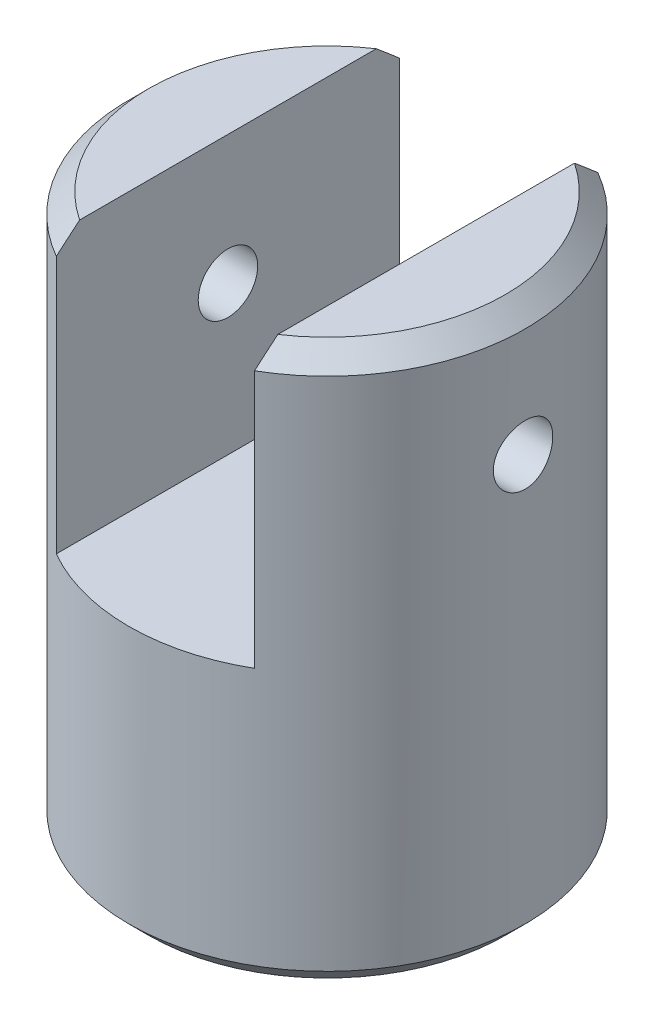
ISO-10303-21;
HEADER;
FILE_DESCRIPTION(('STEP AP214'),'2;1');
FILE_NAME('part.step','',(''),(''),'','','');
FILE_SCHEMA(('AUTOMOTIVE_DESIGN { 1 0 10303 214 1 1 1 1 }'));
ENDSEC;
DATA;
#1=APPLICATION_CONTEXT('core data for automotive mechanical design processes');
#2=APPLICATION_PROTOCOL_DEFINITION('international standard','automotive_design',2000,#1);
#3=PRODUCT_CONTEXT('',#1,'mechanical');
#4=PRODUCT('Part','Part','',(#3));
#5=PRODUCT_RELATED_PRODUCT_CATEGORY('part','',(#4));
#6=PRODUCT_DEFINITION_FORMATION('','',#4);
#7=PRODUCT_DEFINITION_CONTEXT('part definition',#1,'design');
#8=PRODUCT_DEFINITION('design','',#6,#7);
#9=PRODUCT_DEFINITION_SHAPE('','',#8);
#10=(LENGTH_UNIT() NAMED_UNIT(*) SI_UNIT(.MILLI.,.METRE.));
#11=(NAMED_UNIT(*) PLANE_ANGLE_UNIT() SI_UNIT($,.RADIAN.));
#12=(NAMED_UNIT(*) SI_UNIT($,.STERADIAN.) SOLID_ANGLE_UNIT());
#13=UNCERTAINTY_MEASURE_WITH_UNIT(LENGTH_MEASURE(1.E-05),#10,'distance_accuracy_value','');
#14=(GEOMETRIC_REPRESENTATION_CONTEXT(3) GLOBAL_UNCERTAINTY_ASSIGNED_CONTEXT((#13)) GLOBAL_UNIT_ASSIGNED_CONTEXT((#10,
#11,#12)) REPRESENTATION_CONTEXT('',''));
#15=CARTESIAN_POINT('',(0.,0.,0.));
#16=DIRECTION('',(0.,0.,1.));
#17=DIRECTION('',(1.,0.,0.));
#18=AXIS2_PLACEMENT_3D('',#15,#16,#17);
#19=CARTESIAN_POINT('',(0.,14.,0.));
#20=DIRECTION('',(0.,-1.,0.));
#21=DIRECTION('',(0.,0.,-1.));
#22=AXIS2_PLACEMENT_3D('',#19,#20,#21);
#23=CYLINDRICAL_SURFACE('',#22,5.);
#24=CARTESIAN_POINT('',(-4.9434299833213,10.75,-0.750000000000001));
#25=CARTESIAN_POINT('',(-4.94343068334296,10.708127215355,-0.749998270536421));
#26=CARTESIAN_POINT('',(-4.9439677586955,10.6662301246246,-0.746481481942455));
#27=CARTESIAN_POINT('',(-4.9460565740162,10.5836073425584,-0.732510983285004));
#28=CARTESIAN_POINT('',(-4.94760930365715,10.54288283426,-0.722050507013141));
#29=CARTESIAN_POINT('',(-4.95154969493114,10.4638131222765,-0.69451263049042));
#30=CARTESIAN_POINT('',(-4.95393671565768,10.4254661187289,-0.677440308406985));
#31=CARTESIAN_POINT('',(-4.95927597056573,10.352186484614,-0.637175315438957));
#32=CARTESIAN_POINT('',(-4.96222812691834,10.3172533848929,-0.61398348714936));
#33=CARTESIAN_POINT('',(-4.9683914462402,10.2515080916228,-0.561939512092793));
#34=CARTESIAN_POINT('',(-4.97160431229029,10.2207271932966,-0.533048027924102));
#35=CARTESIAN_POINT('',(-4.97791184084524,10.1644312571723,-0.470509802722188));
#36=CARTESIAN_POINT('',(-4.98100649684307,10.1389165089165,-0.436862800393266));
#37=CARTESIAN_POINT('',(-4.98674673714093,10.0937616841543,-0.365568179026373));
#38=CARTESIAN_POINT('',(-4.98939009217784,10.0741504248388,-0.327902113682884));
#39=CARTESIAN_POINT('',(-4.99391103373202,10.0415442005959,-0.249764425053488));
#40=CARTESIAN_POINT('',(-4.99578866070972,10.0285488860786,-0.209292950135339));
#41=CARTESIAN_POINT('',(-4.99855457398891,10.0096383057346,-0.127015561545285));
#42=CARTESIAN_POINT('',(-4.99945017943672,10.0036706368064,-0.0852219421949333));
#43=CARTESIAN_POINT('',(-5.00017622384792,9.99882203258755,-0.00121760200973985));
#44=CARTESIAN_POINT('',(-5.0000067220247,9.99994070334016,0.0409930955078728));
#45=CARTESIAN_POINT('',(-4.99862749830398,10.0091916688812,0.124275859100259));
#46=CARTESIAN_POINT('',(-4.99742613826239,10.0172675858957,0.165354345700003));
#47=CARTESIAN_POINT('',(-4.99412750113925,10.0401153031613,0.245566414571568));
#48=CARTESIAN_POINT('',(-4.99203020099869,10.0548872757507,0.28469994675674));
#49=CARTESIAN_POINT('',(-4.98716096936603,10.0907654984585,0.360081890385158));
#50=CARTESIAN_POINT('',(-4.98438651757819,10.1118954825544,0.396318836161798));
#51=CARTESIAN_POINT('',(-4.97847219122711,10.159872596835,0.464753953575088));
#52=CARTESIAN_POINT('',(-4.97533229261592,10.1867201033534,0.496951859135867));
#53=CARTESIAN_POINT('',(-4.96900079096313,10.2456842244133,0.556727241361322));
#54=CARTESIAN_POINT('',(-4.96580898311628,10.2778500609851,0.584256164754733));
#55=CARTESIAN_POINT('',(-4.95976352226762,10.3463705385619,0.633532996694064));
#56=CARTESIAN_POINT('',(-4.95690987134824,10.38272520536,0.655280869639994));
#57=CARTESIAN_POINT('',(-4.95186387643428,10.4586419814703,0.692384822673024));
#58=CARTESIAN_POINT('',(-4.94967204922646,10.4982065668312,0.707735911350408));
#59=CARTESIAN_POINT('',(-4.9462070144953,10.5793926275737,0.731561681044396));
#60=CARTESIAN_POINT('',(-4.9449337422315,10.6210139577734,0.74003684668663));
#61=CARTESIAN_POINT('',(-4.94346225697513,10.7047000447887,0.749803600433278));
#62=CARTESIAN_POINT('',(-4.94325374401287,10.7467565941008,0.751164016325262));
#63=CARTESIAN_POINT('',(-4.94390803968577,10.8304970974087,0.746845285099096));
#64=CARTESIAN_POINT('',(-4.94477081507889,10.8721810629254,0.741166356411512));
#65=CARTESIAN_POINT('',(-4.94746101230727,10.9537799089828,0.722988514763831));
#66=CARTESIAN_POINT('',(-4.94928358241429,10.9937026024708,0.710523892639104));
#67=CARTESIAN_POINT('',(-4.95368400912884,11.0708920460243,0.679164159735433));
#68=CARTESIAN_POINT('',(-4.95626190303588,11.1081586648141,0.660268731381946));
#69=CARTESIAN_POINT('',(-4.96190677843531,11.1792866301675,0.616418389976619));
#70=CARTESIAN_POINT('',(-4.96497729639994,11.2131202236399,0.591418922808832));
#71=CARTESIAN_POINT('',(-4.97125079716678,11.2761364299369,0.536132084186008));
#72=CARTESIAN_POINT('',(-4.97445378745146,11.3053187795906,0.505844413723399));
#73=CARTESIAN_POINT('',(-4.98066352608693,11.3584513033168,0.440537809814093));
#74=CARTESIAN_POINT('',(-4.98366841730212,11.3823558641212,0.40548156338598));
#75=CARTESIAN_POINT('',(-4.98911452516008,11.4239364526313,0.331811040131841));
#76=CARTESIAN_POINT('',(-4.99155575722282,11.4416126507325,0.29319686068022));
#77=CARTESIAN_POINT('',(-4.99559134830398,11.470161871244,0.213648997930574));
#78=CARTESIAN_POINT('',(-4.9971888085895,11.4810598335392,0.172724429377152));
#79=CARTESIAN_POINT('',(-4.99936988328448,11.4958239397687,0.0896004077505968));
#80=CARTESIAN_POINT('',(-4.99995356465401,11.4996905481246,0.0474010390652906));
#81=CARTESIAN_POINT('',(-5.00004064529571,11.5002708522747,-0.0366322954304091));
#82=CARTESIAN_POINT('',(-4.99955458511898,11.4970543404385,-0.0784657851060259));
#83=CARTESIAN_POINT('',(-4.99757805259571,11.4837093057896,-0.160989897661553));
#84=CARTESIAN_POINT('',(-4.99608758346333,11.4735808050957,-0.201680524198256));
#85=CARTESIAN_POINT('',(-4.99226893371232,11.4467240622149,-0.28074468718983));
#86=CARTESIAN_POINT('',(-4.98994136658473,11.4300006524305,-0.319119896574391));
#87=CARTESIAN_POINT('',(-4.9847041724775,11.3904362560084,-0.392530558948301));
#88=CARTESIAN_POINT('',(-4.98179452660169,11.3675950707598,-0.427565903460355));
#89=CARTESIAN_POINT('',(-4.97568255318089,11.3161911505854,-0.493656292595979));
#90=CARTESIAN_POINT('',(-4.97247774212971,11.2875768870918,-0.524671033223191));
#91=CARTESIAN_POINT('',(-4.96615500844501,11.2255474634598,-0.581484041951338));
#92=CARTESIAN_POINT('',(-4.96303710638146,11.1921311780878,-0.607281083994919));
#93=CARTESIAN_POINT('',(-4.95722242014558,11.1212255083837,-0.653056554114872));
#94=CARTESIAN_POINT('',(-4.95452810078493,11.0837142914891,-0.673001471456045));
#95=CARTESIAN_POINT('',(-4.94989454555362,11.0058516116184,-0.706278069360226));
#96=CARTESIAN_POINT('',(-4.94795452653966,10.9655031460711,-0.719616612874488));
#97=CARTESIAN_POINT('',(-4.94549742762413,10.8958112818718,-0.736274759450132));
#98=CARTESIAN_POINT('',(-4.9447262469119,10.8668983015379,-0.741413848902101));
#99=CARTESIAN_POINT('',(-4.94369228283506,10.8086608541328,-0.748277052882871));
#100=CARTESIAN_POINT('',(-4.94342949288078,10.7793363924002,-0.750001211675379));
#101=CARTESIAN_POINT('',(-4.9434299833213,10.75,-0.750000000000001));
#102=B_SPLINE_CURVE_WITH_KNOTS('',3,(#24,#25,#26,#27,#28,#29,#30,#31,#32,#33,#34,#35,#36,#37,
#38,#39,#40,#41,#42,#43,#44,#45,#46,#47,#48,#49,#50,#51,#52,#53,#54,#55,#56,#57,#58,#59,#60,#61,
#62,#63,#64,#65,#66,#67,#68,#69,#70,#71,#72,#73,#74,#75,#76,#77,#78,#79,#80,#81,#82,#83,#84,#85,
#86,#87,#88,#89,#90,#91,#92,#93,#94,#95,#96,#97,#98,#99,#100,#101),.UNSPECIFIED.,.T.,.F.,(4,2,2,
2,2,2,2,2,2,2,2,2,2,2,2,2,2,2,2,2,2,2,2,2,2,2,2,2,2,2,2,2,2,2,2,2,2,2,4),(0.,0.125511125902433,
0.2511447347809,0.376682042667836,0.502202074330662,0.628620793245537,0.755046461039085,
0.88207961052891,1.0091060468225,1.13517916267198,1.26124526969687,1.38629931257864,
1.51135657419701,1.63688658193227,1.76242485474636,1.88919772333135,2.01597137257175,
2.14284375886569,2.26970720222171,2.39534107301872,2.52097104549959,2.64597197403687,
2.77097907643058,2.89692743000651,3.02288290730901,3.14988768876758,3.27688899535927,
3.40342020445545,3.52994305585237,3.65522481811163,3.78050617946411,3.90569591128917,
4.03088970783553,4.15725475005485,4.28364945118431,4.41075439412466,4.53772701722782,
4.62566220945807,4.71359626188096),.UNSPECIFIED.);
#103=CARTESIAN_POINT('',(-4.9434299833213,10.75,-0.750000000000001));
#104=VERTEX_POINT('',#103);
#105=EDGE_CURVE('E202',#104,#104,#102,.T.);
#106=ORIENTED_EDGE('',*,*,#105,.F.);
#107=EDGE_LOOP('',(#106));
#108=FACE_BOUND('',#107,.T.);
#109=CARTESIAN_POINT('',(0.,0.499999999999999,0.));
#110=DIRECTION('',(0.,1.,0.));
#111=DIRECTION('',(0.,0.,1.));
#112=AXIS2_PLACEMENT_3D('',#109,#110,#111);
#113=CIRCLE('',#112,5.);
#114=CARTESIAN_POINT('',(0.,0.499999999999999,5.));
#115=VERTEX_POINT('',#114);
#116=EDGE_CURVE('E113',#115,#115,#113,.T.);
#117=ORIENTED_EDGE('',*,*,#116,.T.);
#118=EDGE_LOOP('',(#117));
#119=FACE_BOUND('',#118,.T.);
#120=CARTESIAN_POINT('',(0.,13.5,0.));
#121=DIRECTION('',(0.,1.,0.));
#122=DIRECTION('',(0.,0.,1.));
#123=AXIS2_PLACEMENT_3D('',#120,#121,#122);
#124=CIRCLE('',#123,5.);
#125=CARTESIAN_POINT('',(2.5,13.5,-4.33012701892219));
#126=VERTEX_POINT('',#125);
#127=CARTESIAN_POINT('',(2.5,13.4999999999999,4.33012701892231));
#128=VERTEX_POINT('',#127);
#129=EDGE_CURVE('E160',#126,#128,#124,.F.);
#130=ORIENTED_EDGE('',*,*,#129,.T.);
#131=DIRECTION('',(0.,-1.,0.));
#132=VECTOR('',#131,1.);
#133=CARTESIAN_POINT('',(2.5,14.,4.33012701892219));
#134=LINE('',#133,#132);
#135=CARTESIAN_POINT('',(2.5,7.,4.33012701892219));
#136=VERTEX_POINT('',#135);
#137=EDGE_CURVE('E62',#128,#136,#134,.T.);
#138=ORIENTED_EDGE('',*,*,#137,.T.);
#139=CARTESIAN_POINT('',(0.,7.,0.));
#140=DIRECTION('',(0.,-1.,0.));
#141=DIRECTION('',(0.,0.,-1.));
#142=AXIS2_PLACEMENT_3D('',#139,#140,#141);
#143=CIRCLE('',#142,5.);
#144=CARTESIAN_POINT('',(-2.5,7.,4.3301270189222));
#145=VERTEX_POINT('',#144);
#146=EDGE_CURVE('E175',#136,#145,#143,.T.);
#147=ORIENTED_EDGE('',*,*,#146,.T.);
#148=DIRECTION('',(0.,-1.,0.));
#149=VECTOR('',#148,1.);
#150=CARTESIAN_POINT('',(-2.5,14.,4.3301270189222));
#151=LINE('',#150,#149);
#152=CARTESIAN_POINT('',(-2.5,13.5,4.3301270189222));
#153=VERTEX_POINT('',#152);
#154=EDGE_CURVE('E172',#145,#153,#151,.F.);
#155=ORIENTED_EDGE('',*,*,#154,.T.);
#156=CARTESIAN_POINT('',(-2.5,13.4999999999999,-4.33012701892231));
#157=VERTEX_POINT('',#156);
#158=EDGE_CURVE('E159',#153,#157,#124,.F.);
#159=ORIENTED_EDGE('',*,*,#158,.T.);
#160=DIRECTION('',(0.,-1.,0.));
#161=VECTOR('',#160,1.);
#162=CARTESIAN_POINT('',(-2.5,14.,-4.33012701892219));
#163=LINE('',#162,#161);
#164=CARTESIAN_POINT('',(-2.5,7.,-4.33012701892219));
#165=VERTEX_POINT('',#164);
#166=EDGE_CURVE('E95',#157,#165,#163,.T.);
#167=ORIENTED_EDGE('',*,*,#166,.T.);
#168=CARTESIAN_POINT('',(2.5,7.,-4.33012701892219));
#169=VERTEX_POINT('',#168);
#170=EDGE_CURVE('E119',#165,#169,#143,.T.);
#171=ORIENTED_EDGE('',*,*,#170,.T.);
#172=DIRECTION('',(0.,-1.,0.));
#173=VECTOR('',#172,1.);
#174=CARTESIAN_POINT('',(2.5,14.,-4.33012701892219));
#175=LINE('',#174,#173);
#176=EDGE_CURVE('E168',#169,#126,#175,.F.);
#177=ORIENTED_EDGE('',*,*,#176,.T.);
#178=EDGE_LOOP('',(#130,#138,#147,#155,#159,#167,#171,#177));
#179=FACE_BOUND('',#178,.T.);
#180=CARTESIAN_POINT('',(4.9434299833213,10.75,0.75));
#181=CARTESIAN_POINT('',(4.94343068334296,10.791872784645,0.749998270536421));
#182=CARTESIAN_POINT('',(4.9439677586955,10.8337698753754,0.746481481942454));
#183=CARTESIAN_POINT('',(4.9460565740162,10.9163926574416,0.732510983285004));
#184=CARTESIAN_POINT('',(4.94760930365715,10.95711716574,0.722050507013141));
#185=CARTESIAN_POINT('',(4.95154969493114,11.0361868777235,0.69451263049042));
#186=CARTESIAN_POINT('',(4.95393671565768,11.0745338812711,0.677440308406985));
#187=CARTESIAN_POINT('',(4.95927597056573,11.147813515386,0.637175315438957));
#188=CARTESIAN_POINT('',(4.96222812691834,11.1827466151071,0.613983487149359));
#189=CARTESIAN_POINT('',(4.9683914462402,11.2484919083772,0.561939512092793));
#190=CARTESIAN_POINT('',(4.97160431229029,11.2792728067034,0.533048027924102));
#191=CARTESIAN_POINT('',(4.97791184084524,11.3355687428278,0.470509802722188));
#192=CARTESIAN_POINT('',(4.98100649684307,11.3610834910835,0.436862800393266));
#193=CARTESIAN_POINT('',(4.98674673714093,11.4062383158457,0.365568179026373));
#194=CARTESIAN_POINT('',(4.98939009217784,11.4258495751612,0.327902113682884));
#195=CARTESIAN_POINT('',(4.99391103373202,11.4584557994041,0.249764425053488));
#196=CARTESIAN_POINT('',(4.99578866070972,11.4714511139214,0.209292950135339));
#197=CARTESIAN_POINT('',(4.99855457398891,11.4903616942654,0.127015561545285));
#198=CARTESIAN_POINT('',(4.99945017943672,11.4963293631936,0.0852219421949331));
#199=CARTESIAN_POINT('',(5.00017622384792,11.5011779674124,0.00121760200973962));
#200=CARTESIAN_POINT('',(5.0000067220247,11.5000592966598,-0.040993095507873));
#201=CARTESIAN_POINT('',(4.99862749830398,11.4908083311188,-0.12427585910026));
#202=CARTESIAN_POINT('',(4.99742613826239,11.4827324141043,-0.165354345700004));
#203=CARTESIAN_POINT('',(4.99412750113925,11.4598846968387,-0.245566414571568));
#204=CARTESIAN_POINT('',(4.99203020099869,11.4451127242493,-0.28469994675674));
#205=CARTESIAN_POINT('',(4.98716096936603,11.4092345015415,-0.360081890385158));
#206=CARTESIAN_POINT('',(4.98438651757819,11.3881045174456,-0.396318836161798));
#207=CARTESIAN_POINT('',(4.97847219122711,11.340127403165,-0.464753953575088));
#208=CARTESIAN_POINT('',(4.97533229261592,11.3132798966466,-0.496951859135867));
#209=CARTESIAN_POINT('',(4.96900079096313,11.2543157755867,-0.556727241361323));
#210=CARTESIAN_POINT('',(4.96580898311628,11.2221499390149,-0.584256164754733));
#211=CARTESIAN_POINT('',(4.95976352226762,11.1536294614381,-0.633532996694064));
#212=CARTESIAN_POINT('',(4.95690987134824,11.11727479464,-0.655280869639995));
#213=CARTESIAN_POINT('',(4.95186387643428,11.0413580185297,-0.692384822673024));
#214=CARTESIAN_POINT('',(4.94967204922646,11.0017934331688,-0.707735911350408));
#215=CARTESIAN_POINT('',(4.9462070144953,10.9206073724263,-0.731561681044396));
#216=CARTESIAN_POINT('',(4.9449337422315,10.8789860422266,-0.74003684668663));
#217=CARTESIAN_POINT('',(4.94346225697513,10.7952999552113,-0.749803600433278));
#218=CARTESIAN_POINT('',(4.94325374401287,10.7532434058992,-0.751164016325262));
#219=CARTESIAN_POINT('',(4.94390803968577,10.6695029025913,-0.746845285099096));
#220=CARTESIAN_POINT('',(4.94477081507889,10.6278189370746,-0.741166356411512));
#221=CARTESIAN_POINT('',(4.94746101230727,10.5462200910172,-0.722988514763831));
#222=CARTESIAN_POINT('',(4.94928358241429,10.5062973975292,-0.710523892639104));
#223=CARTESIAN_POINT('',(4.95368400912884,10.4291079539757,-0.679164159735434));
#224=CARTESIAN_POINT('',(4.95626190303588,10.3918413351859,-0.660268731381946));
#225=CARTESIAN_POINT('',(4.96190677843531,10.3207133698325,-0.616418389976619));
#226=CARTESIAN_POINT('',(4.96497729639994,10.2868797763601,-0.591418922808832));
#227=CARTESIAN_POINT('',(4.97125079716678,10.2238635700631,-0.536132084186009));
#228=CARTESIAN_POINT('',(4.97445378745146,10.1946812204094,-0.505844413723399));
#229=CARTESIAN_POINT('',(4.98066352608693,10.1415486966832,-0.440537809814094));
#230=CARTESIAN_POINT('',(4.98366841730212,10.1176441358788,-0.40548156338598));
#231=CARTESIAN_POINT('',(4.98911452516008,10.0760635473687,-0.331811040131842));
#232=CARTESIAN_POINT('',(4.99155575722282,10.0583873492675,-0.293196860680221));
#233=CARTESIAN_POINT('',(4.99559134830398,10.029838128756,-0.213648997930575));
#234=CARTESIAN_POINT('',(4.9971888085895,10.0189401664608,-0.172724429377152));
#235=CARTESIAN_POINT('',(4.99936988328448,10.0041760602313,-0.0896004077505977));
#236=CARTESIAN_POINT('',(4.99995356465401,10.0003094518754,-0.0474010390652915));
#237=CARTESIAN_POINT('',(5.00004064529571,9.9997291477253,0.0366322954304083));
#238=CARTESIAN_POINT('',(4.99955458511898,10.0029456595615,0.0784657851060251));
#239=CARTESIAN_POINT('',(4.99757805259571,10.0162906942104,0.160989897661553));
#240=CARTESIAN_POINT('',(4.99608758346333,10.0264191949043,0.201680524198256));
#241=CARTESIAN_POINT('',(4.99226893371232,10.0532759377851,0.28074468718983));
#242=CARTESIAN_POINT('',(4.98994136658473,10.0699993475695,0.319119896574391));
#243=CARTESIAN_POINT('',(4.9847041724775,10.1095637439916,0.392530558948301));
#244=CARTESIAN_POINT('',(4.98179452660169,10.1324049292402,0.427565903460354));
#245=CARTESIAN_POINT('',(4.97568255318089,10.1838088494146,0.493656292595979));
#246=CARTESIAN_POINT('',(4.97247774212971,10.2124231129082,0.524671033223191));
#247=CARTESIAN_POINT('',(4.96615500844501,10.2744525365402,0.581484041951339));
#248=CARTESIAN_POINT('',(4.96303710638146,10.3078688219122,0.607281083994919));
#249=CARTESIAN_POINT('',(4.95722242014558,10.3787744916163,0.653056554114872));
#250=CARTESIAN_POINT('',(4.95452810078493,10.4162857085109,0.673001471456045));
#251=CARTESIAN_POINT('',(4.94989454555362,10.4941483883817,0.706278069360226));
#252=CARTESIAN_POINT('',(4.94795452653966,10.5344968539289,0.719616612874488));
#253=CARTESIAN_POINT('',(4.94549742762413,10.6041887181282,0.736274759450132));
#254=CARTESIAN_POINT('',(4.9447262469119,10.6331016984621,0.741413848902101));
#255=CARTESIAN_POINT('',(4.94369228283506,10.6913391458672,0.748277052882871));
#256=CARTESIAN_POINT('',(4.94342949288078,10.7206636075998,0.750001211675379));
#257=CARTESIAN_POINT('',(4.9434299833213,10.75,0.75));
#258=B_SPLINE_CURVE_WITH_KNOTS('',3,(#180,#181,#182,#183,#184,#185,#186,#187,#188,#189,#190,
#191,#192,#193,#194,#195,#196,#197,#198,#199,#200,#201,#202,#203,#204,#205,#206,#207,#208,#209,
#210,#211,#212,#213,#214,#215,#216,#217,#218,#219,#220,#221,#222,#223,#224,#225,#226,#227,#228,
#229,#230,#231,#232,#233,#234,#235,#236,#237,#238,#239,#240,#241,#242,#243,#244,#245,#246,#247,
#248,#249,#250,#251,#252,#253,#254,#255,#256,#257),.UNSPECIFIED.,.T.,.F.,(4,2,2,2,2,2,2,2,2,2,2,
2,2,2,2,2,2,2,2,2,2,2,2,2,2,2,2,2,2,2,2,2,2,2,2,2,2,2,4),(0.,0.125511125902433,0.2511447347809,
0.376682042667836,0.502202074330662,0.628620793245537,0.755046461039085,0.88207961052891,
1.0091060468225,1.13517916267198,1.26124526969687,1.38629931257864,1.51135657419701,
1.63688658193227,1.76242485474636,1.88919772333135,2.01597137257175,2.14284375886569,
2.26970720222171,2.39534107301872,2.52097104549959,2.64597197403687,2.77097907643058,
2.89692743000651,3.02288290730901,3.14988768876758,3.27688899535927,3.40342020445545,
3.52994305585237,3.65522481811163,3.78050617946412,3.90569591128917,4.03088970783553,
4.15725475005485,4.28364945118431,4.41075439412466,4.53772701722782,4.62566220945807,
4.71359626188096),.UNSPECIFIED.);
#259=CARTESIAN_POINT('',(4.9434299833213,10.75,0.75));
#260=VERTEX_POINT('',#259);
#261=EDGE_CURVE('E106',#260,#260,#258,.T.);
#262=ORIENTED_EDGE('',*,*,#261,.T.);
#263=EDGE_LOOP('',(#262));
#264=FACE_BOUND('',#263,.T.);
#265=ADVANCED_FACE('F34',(#108,#119,#179,#264),#23,.T.);
#266=CARTESIAN_POINT('',(2.5,7.,-5.));
#267=DIRECTION('',(1.,0.,0.));
#268=DIRECTION('',(0.,0.,-1.));
#269=AXIS2_PLACEMENT_3D('',#266,#267,#268);
#270=PLANE('',#269);
#271=CARTESIAN_POINT('',(2.5,7.49230468164976,10.7200445997966));
#272=CARTESIAN_POINT('',(2.5,7.75506756636977,10.4502132832323));
#273=CARTESIAN_POINT('',(2.5,8.01758510829374,10.1801421958178));
#274=CARTESIAN_POINT('',(2.5,8.54196313580733,9.63934488119114));
#275=CARTESIAN_POINT('',(2.5,8.80382359832416,9.36861863161152));
#276=CARTESIAN_POINT('',(2.5,9.32732256665294,8.82571139176574));
#277=CARTESIAN_POINT('',(2.5,9.5889590751083,8.55352847435077));
#278=CARTESIAN_POINT('',(2.5,10.1111100876743,8.00810209070006));
#279=CARTESIAN_POINT('',(2.5,10.3716246226112,7.73485865399944));
#280=CARTESIAN_POINT('',(2.5,10.9274271051678,7.1486869879645));
#281=CARTESIAN_POINT('',(2.5,11.2224905136658,6.83554566200725));
#282=CARTESIAN_POINT('',(2.5,11.8098036619689,6.20657096159051));
#283=CARTESIAN_POINT('',(2.5,12.1020531394998,5.89073734126856));
#284=CARTESIAN_POINT('',(2.5,12.5368245533138,5.41420501609597));
#285=CARTESIAN_POINT('',(2.5,12.6810236006092,5.25503739000377));
#286=CARTESIAN_POINT('',(2.5,12.9679780699096,4.93540730469388));
#287=CARTESIAN_POINT('',(2.5,13.1107335095992,4.77494486138156));
#288=CARTESIAN_POINT('',(2.5,13.3943352959092,4.45238307130351));
#289=CARTESIAN_POINT('',(2.5,13.5351819344881,4.29028398164157));
#290=CARTESIAN_POINT('',(2.5,13.8143346592327,3.96391676555558));
#291=CARTESIAN_POINT('',(2.5,13.9526408687089,3.79964874507863));
#292=CARTESIAN_POINT('',(2.5,14.1765463438924,3.52786693839434));
#293=CARTESIAN_POINT('',(2.5,14.2631917184952,3.42121588972721));
#294=CARTESIAN_POINT('',(2.5,14.434650967256,3.20643950812956));
#295=CARTESIAN_POINT('',(2.5,14.5194647583396,3.09831410868889));
#296=CARTESIAN_POINT('',(2.5,14.6869907632852,2.87992439432935));
#297=CARTESIAN_POINT('',(2.5,14.7696958944985,2.76965462746721));
#298=CARTESIAN_POINT('',(2.5,14.9319982014881,2.54685447802807));
#299=CARTESIAN_POINT('',(2.5,15.0115956601429,2.43432430262538));
#300=CARTESIAN_POINT('',(2.5,15.1645871568412,2.2094333924181));
#301=CARTESIAN_POINT('',(2.5,15.2380895732178,2.0971468571604));
#302=CARTESIAN_POINT('',(2.5,15.3797803212791,1.86915932082887));
#303=CARTESIAN_POINT('',(2.5,15.4479661145626,1.75345672467647));
#304=CARTESIAN_POINT('',(2.5,15.5766027847052,1.51851163818868));
#305=CARTESIAN_POINT('',(2.5,15.637089613119,1.39928906505602));
#306=CARTESIAN_POINT('',(2.5,15.7477122322526,1.15618552956646));
#307=CARTESIAN_POINT('',(2.5,15.7978619346617,1.03231109679894));
#308=CARTESIAN_POINT('',(2.5,15.8657113940024,0.833161623232762));
#309=CARTESIAN_POINT('',(2.5,15.888161956003,0.75950663533327));
#310=CARTESIAN_POINT('',(2.5,15.9274941305695,0.610683795946784));
#311=CARTESIAN_POINT('',(2.5,15.9443745255628,0.535515617499099));
#312=CARTESIAN_POINT('',(2.5,15.9717167247348,0.384336717463551));
#313=CARTESIAN_POINT('',(2.5,15.9822056590697,0.308330971298985));
#314=CARTESIAN_POINT('',(2.5,15.9963092567708,0.155686756839111));
#315=CARTESIAN_POINT('',(2.5,15.9999251105075,0.0790484004172064));
#316=CARTESIAN_POINT('',(2.5,16.0000728245547,-0.0744968895515405));
#317=CARTESIAN_POINT('',(2.5,15.99658048878,-0.151403847872895));
#318=CARTESIAN_POINT('',(2.5,15.9826702329363,-0.304582243916141));
#319=CARTESIAN_POINT('',(2.5,15.972251909262,-0.38085364433922));
#320=CARTESIAN_POINT('',(2.5,15.9450010489905,-0.532556249007512));
#321=CARTESIAN_POINT('',(2.5,15.9281417728176,-0.607982582825233));
#322=CARTESIAN_POINT('',(2.5,15.8887997060919,-0.757336293494587));
#323=CARTESIAN_POINT('',(2.5,15.8663164424582,-0.831263543679831));
#324=CARTESIAN_POINT('',(2.5,15.7874453384756,-1.06314705148186));
#325=CARTESIAN_POINT('',(2.5,15.7221939550254,-1.21808765790563));
#326=CARTESIAN_POINT('',(2.5,15.5767773878069,-1.52084061094836));
#327=CARTESIAN_POINT('',(2.5,15.4965833852095,-1.66863847619157));
#328=CARTESIAN_POINT('',(2.5,15.3686614858512,-1.88645685019238));
#329=CARTESIAN_POINT('',(2.5,15.324581172047,-1.95866246406654));
#330=CARTESIAN_POINT('',(2.5,15.2343633229119,-2.10178037140046));
#331=CARTESIAN_POINT('',(2.5,15.1882257419775,-2.17269263614136));
#332=CARTESIAN_POINT('',(2.5,15.0943114761419,-2.31331965029671));
#333=CARTESIAN_POINT('',(2.5,15.0465364113601,-2.38303548646622));
#334=CARTESIAN_POINT('',(2.5,14.9495871644524,-2.52148130605297));
#335=CARTESIAN_POINT('',(2.5,14.9004130325294,-2.59021132471161));
#336=CARTESIAN_POINT('',(2.5,14.7418086022003,-2.80794039877899));
#337=CARTESIAN_POINT('',(2.5,14.6301717804063,-2.95533231754791));
#338=CARTESIAN_POINT('',(2.5,14.4030119535972,-3.2470995775914));
#339=CARTESIAN_POINT('',(2.5,14.2874883395453,-3.39147444031171));
#340=CARTESIAN_POINT('',(2.5,14.0535706726081,-3.67798515912078));
#341=CARTESIAN_POINT('',(2.5,13.9351753161494,-3.82011994817957));
#342=CARTESIAN_POINT('',(2.5,13.6962779413685,-4.10261115079802));
#343=CARTESIAN_POINT('',(2.5,13.5757758471217,-4.24296749994891));
#344=CARTESIAN_POINT('',(2.5,13.3329591472947,-4.52251191771861));
#345=CARTESIAN_POINT('',(2.5,13.2106418550402,-4.66169764868645));
#346=CARTESIAN_POINT('',(2.5,12.9647399289612,-4.93894605483598));
#347=CARTESIAN_POINT('',(2.5,12.8411552809227,-5.07700871739071));
#348=CARTESIAN_POINT('',(2.5,12.4689754027014,-5.48976339446039));
#349=CARTESIAN_POINT('',(2.5,12.2188823489959,-5.76310419169612));
#350=CARTESIAN_POINT('',(2.5,11.7167631897699,-6.30658337970288));
#351=CARTESIAN_POINT('',(2.5,11.464744423164,-6.57672857694711));
#352=CARTESIAN_POINT('',(2.5,10.9588450798599,-7.11530352125393));
#353=CARTESIAN_POINT('',(2.5,10.7049643759338,-7.38373314869975));
#354=CARTESIAN_POINT('',(2.5,10.1960642778904,-7.91910575256703));
#355=CARTESIAN_POINT('',(2.5,9.94104594180954,-8.18604973593262));
#356=CARTESIAN_POINT('',(2.5,9.43000485919243,-8.71897466100184));
#357=CARTESIAN_POINT('',(2.5,9.17398211144013,-8.98495560153878));
#358=CARTESIAN_POINT('',(2.5,8.79910159811315,-9.37328370316923));
#359=CARTESIAN_POINT('',(2.5,8.68054798765262,-9.49592474663264));
#360=CARTESIAN_POINT('',(2.5,8.44327874422361,-9.74107771699721));
#361=CARTESIAN_POINT('',(2.5,8.32456309397788,-9.86358962717925));
#362=CARTESIAN_POINT('',(2.5,8.08698533845364,-10.1084993459394));
#363=CARTESIAN_POINT('',(2.5,7.96812321757388,-10.2308971393808));
#364=CARTESIAN_POINT('',(2.5,7.73029338471663,-10.475562124604));
#365=CARTESIAN_POINT('',(2.5,7.61132568679086,-10.5978293300444));
#366=CARTESIAN_POINT('',(2.5,7.49230468164976,-10.7200445997966));
#367=B_SPLINE_CURVE_WITH_KNOTS('',3,(#271,#272,#273,#274,#275,#276,#277,#278,#279,#280,#281,
#282,#283,#284,#285,#286,#287,#288,#289,#290,#291,#292,#293,#294,#295,#296,#297,#298,#299,#300,
#301,#302,#303,#304,#305,#306,#307,#308,#309,#310,#311,#312,#313,#314,#315,#316,#317,#318,#319,
#320,#321,#322,#323,#324,#325,#326,#327,#328,#329,#330,#331,#332,#333,#334,#335,#336,#337,#338,
#339,#340,#341,#342,#343,#344,#345,#346,#347,#348,#349,#350,#351,#352,#353,#354,#355,#356,#357,
#358,#359,#360,#361,#362,#363,#364,#365,#366),.UNSPECIFIED.,.F.,.F.,(4,2,2,2,2,2,2,2,2,2,2,2,2,
2,2,2,2,2,2,2,2,2,2,2,2,2,2,2,2,2,2,2,2,2,2,2,2,2,2,2,2,2,2,2,2,2,2,4),(0.,1.129903177141,
2.2598454896959,3.39246613245,4.52505545523974,5.8158126607009,7.10668902956722,
7.75100347520628,8.39531001817709,9.0395168736972,9.68369237681629,10.0959110309072,
10.5081483427213,10.9216246705417,11.3350632731853,11.7375696522995,12.1402670445238,
12.5410090138358,12.9412080923069,13.1720313762002,13.4029050819565,13.6327918327882,
13.86263876518,14.0932693987257,14.3239134732292,14.5555256571908,14.7871573305593,
15.2901376383655,15.7940982443734,16.0478616380057,16.3016306596197,16.5551554667907,
16.8086711881526,17.3632568495349,17.9179298196026,18.4728594677621,19.0278091563874,
19.5836839775548,20.1395650399658,21.2509998382779,22.359334083863,23.467744782086,
24.5752798183885,25.6828161959835,26.1945407059112,26.7063248724215,27.2181693109022,
27.7299535934082),.UNSPECIFIED.);
#368=CARTESIAN_POINT('',(2.5,14.,3.74165738677394));
#369=VERTEX_POINT('',#368);
#370=EDGE_CURVE('E11',#128,#369,#367,.T.);
#371=ORIENTED_EDGE('',*,*,#370,.T.);
#372=DIRECTION('',(0.,0.,-1.));
#373=VECTOR('',#372,1.);
#374=CARTESIAN_POINT('',(2.5,14.,-5.));
#375=LINE('',#374,#373);
#376=CARTESIAN_POINT('',(2.5,14.,-3.74165738677394));
#377=VERTEX_POINT('',#376);
#378=EDGE_CURVE('E105',#369,#377,#375,.T.);
#379=ORIENTED_EDGE('',*,*,#378,.T.);
#380=EDGE_CURVE('E39',#377,#126,#367,.T.);
#381=ORIENTED_EDGE('',*,*,#380,.T.);
#382=ORIENTED_EDGE('',*,*,#176,.F.);
#383=DIRECTION('',(0.,0.,-1.));
#384=VECTOR('',#383,1.);
#385=CARTESIAN_POINT('',(2.5,7.,-5.));
#386=LINE('',#385,#384);
#387=EDGE_CURVE('E120',#136,#169,#386,.T.);
#388=ORIENTED_EDGE('',*,*,#387,.F.);
#389=ORIENTED_EDGE('',*,*,#137,.F.);
#390=EDGE_LOOP('',(#371,#379,#381,#382,#388,#389));
#391=FACE_BOUND('',#390,.T.);
#392=CARTESIAN_POINT('',(2.5,10.75,0.));
#393=DIRECTION('',(1.,0.,0.));
#394=DIRECTION('',(0.,0.,-1.));
#395=AXIS2_PLACEMENT_3D('',#392,#393,#394);
#396=CIRCLE('',#395,0.75);
#397=CARTESIAN_POINT('',(2.5,10.75,-0.750000000000001));
#398=VERTEX_POINT('',#397);
#399=EDGE_CURVE('E190',#398,#398,#396,.T.);
#400=ORIENTED_EDGE('',*,*,#399,.T.);
#401=EDGE_LOOP('',(#400));
#402=FACE_BOUND('',#401,.T.);
#403=ADVANCED_FACE('F132',(#391,#402),#270,.F.);
#404=CARTESIAN_POINT('',(0.,14.,0.));
#405=DIRECTION('',(0.,1.,0.));
#406=DIRECTION('',(0.,0.,1.));
#407=AXIS2_PLACEMENT_3D('',#404,#405,#406);
#408=PLANE('',#407);
#409=ORIENTED_EDGE('',*,*,#378,.F.);
#410=CARTESIAN_POINT('',(0.,14.,0.));
#411=DIRECTION('',(0.,1.,0.));
#412=DIRECTION('',(0.,0.,1.));
#413=AXIS2_PLACEMENT_3D('',#410,#411,#412);
#414=CIRCLE('',#413,4.5);
#415=EDGE_CURVE('E108',#369,#377,#414,.T.);
#416=ORIENTED_EDGE('',*,*,#415,.T.);
#417=EDGE_LOOP('',(#409,#416));
#418=FACE_BOUND('',#417,.T.);
#419=ADVANCED_FACE('F142',(#418),#408,.T.);
#420=CARTESIAN_POINT('',(0.,14.,0.));
#421=DIRECTION('',(0.,-1.,0.));
#422=DIRECTION('',(0.,0.,-1.));
#423=AXIS2_PLACEMENT_3D('',#420,#421,#422);
#424=CONICAL_SURFACE('',#423,4.5,0.785398163397447);
#425=ORIENTED_EDGE('',*,*,#370,.F.);
#426=ORIENTED_EDGE('',*,*,#129,.F.);
#427=ORIENTED_EDGE('',*,*,#380,.F.);
#428=ORIENTED_EDGE('',*,*,#415,.F.);
#429=EDGE_LOOP('',(#425,#426,#427,#428));
#430=FACE_BOUND('',#429,.T.);
#431=ADVANCED_FACE('F141',(#430),#424,.T.);
#432=DIRECTION('',(0.,0.,1.));
#433=VECTOR('',#432,1.);
#434=CARTESIAN_POINT('',(-2.5,14.,-5.));
#435=LINE('',#434,#433);
#436=CARTESIAN_POINT('',(-2.5,14.,-3.74165738677394));
#437=VERTEX_POINT('',#436);
#438=CARTESIAN_POINT('',(-2.5,14.,3.74165738677394));
#439=VERTEX_POINT('',#438);
#440=EDGE_CURVE('E55',#437,#439,#435,.T.);
#441=ORIENTED_EDGE('',*,*,#440,.F.);
#442=EDGE_CURVE('E104',#437,#439,#414,.T.);
#443=ORIENTED_EDGE('',*,*,#442,.T.);
#444=EDGE_LOOP('',(#441,#443));
#445=FACE_BOUND('',#444,.T.);
#446=ADVANCED_FACE('F103',(#445),#408,.T.);
#447=CARTESIAN_POINT('',(0.,0.,0.));
#448=DIRECTION('',(0.,1.,0.));
#449=DIRECTION('',(0.,0.,1.));
#450=AXIS2_PLACEMENT_3D('',#447,#448,#449);
#451=PLANE('',#450);
#452=CARTESIAN_POINT('',(0.,0.,0.));
#453=DIRECTION('',(0.,-1.,0.));
#454=DIRECTION('',(0.,0.,-1.));
#455=AXIS2_PLACEMENT_3D('',#452,#453,#454);
#456=CIRCLE('',#455,0.75);
#457=CARTESIAN_POINT('',(0.,0.,-0.75));
#458=VERTEX_POINT('',#457);
#459=EDGE_CURVE('E164',#458,#458,#456,.T.);
#460=ORIENTED_EDGE('',*,*,#459,.F.);
#461=EDGE_LOOP('',(#460));
#462=FACE_BOUND('',#461,.T.);
#463=CARTESIAN_POINT('',(0.,0.,0.));
#464=DIRECTION('',(0.,1.,0.));
#465=DIRECTION('',(0.,0.,1.));
#466=AXIS2_PLACEMENT_3D('',#463,#464,#465);
#467=CIRCLE('',#466,4.5);
#468=CARTESIAN_POINT('',(0.,0.,4.5));
#469=VERTEX_POINT('',#468);
#470=EDGE_CURVE('E109',#469,#469,#467,.F.);
#471=ORIENTED_EDGE('',*,*,#470,.T.);
#472=EDGE_LOOP('',(#471));
#473=FACE_BOUND('',#472,.T.);
#474=ADVANCED_FACE('F140',(#462,#473),#451,.F.);
#475=CARTESIAN_POINT('',(0.,0.499999999999999,0.));
#476=DIRECTION('',(0.,1.,0.));
#477=DIRECTION('',(0.,0.,1.));
#478=AXIS2_PLACEMENT_3D('',#475,#476,#477);
#479=CONICAL_SURFACE('',#478,5.,0.78539816339745);
#480=ORIENTED_EDGE('',*,*,#470,.F.);
#481=EDGE_LOOP('',(#480));
#482=FACE_BOUND('',#481,.T.);
#483=ORIENTED_EDGE('',*,*,#116,.F.);
#484=EDGE_LOOP('',(#483));
#485=FACE_BOUND('',#484,.T.);
#486=ADVANCED_FACE('F145',(#482,#485),#479,.T.);
#487=CARTESIAN_POINT('',(-2.5,7.49230468164976,-10.7200445997966));
#488=CARTESIAN_POINT('',(-2.5,7.75506756636977,-10.4502132832323));
#489=CARTESIAN_POINT('',(-2.5,8.01758510829374,-10.1801421958178));
#490=CARTESIAN_POINT('',(-2.5,8.54196313580733,-9.63934488119114));
#491=CARTESIAN_POINT('',(-2.5,8.80382359832416,-9.36861863161152));
#492=CARTESIAN_POINT('',(-2.5,9.32732256665293,-8.82571139176575));
#493=CARTESIAN_POINT('',(-2.5,9.58895907510829,-8.55352847435077));
#494=CARTESIAN_POINT('',(-2.5,10.1111100876743,-8.00810209070006));
#495=CARTESIAN_POINT('',(-2.5,10.3716246226112,-7.73485865399944));
#496=CARTESIAN_POINT('',(-2.5,10.9274271051678,-7.1486869879645));
#497=CARTESIAN_POINT('',(-2.5,11.2224905136658,-6.83554566200726));
#498=CARTESIAN_POINT('',(-2.5,11.8098036619689,-6.20657096159051));
#499=CARTESIAN_POINT('',(-2.5,12.1020531394998,-5.89073734126856));
#500=CARTESIAN_POINT('',(-2.5,12.5368245533138,-5.41420501609596));
#501=CARTESIAN_POINT('',(-2.5,12.6810236006092,-5.25503739000377));
#502=CARTESIAN_POINT('',(-2.5,12.9679780699096,-4.93540730469387));
#503=CARTESIAN_POINT('',(-2.5,13.1107335095992,-4.77494486138155));
#504=CARTESIAN_POINT('',(-2.5,13.3943352959092,-4.4523830713035));
#505=CARTESIAN_POINT('',(-2.5,13.5351819344881,-4.29028398164156));
#506=CARTESIAN_POINT('',(-2.5,13.8143346592327,-3.96391676555556));
#507=CARTESIAN_POINT('',(-2.5,13.9526408687089,-3.79964874507861));
#508=CARTESIAN_POINT('',(-2.5,14.1765463438924,-3.52786693839432));
#509=CARTESIAN_POINT('',(-2.5,14.2631917184952,-3.4212158897272));
#510=CARTESIAN_POINT('',(-2.5,14.434650967256,-3.20643950812955));
#511=CARTESIAN_POINT('',(-2.5,14.5194647583396,-3.09831410868888));
#512=CARTESIAN_POINT('',(-2.5,14.6869907632852,-2.87992439432933));
#513=CARTESIAN_POINT('',(-2.5,14.7696958944985,-2.7696546274672));
#514=CARTESIAN_POINT('',(-2.5,14.9319982014882,-2.54685447802805));
#515=CARTESIAN_POINT('',(-2.5,15.0115956601429,-2.43432430262536));
#516=CARTESIAN_POINT('',(-2.5,15.1645871568412,-2.20943339241808));
#517=CARTESIAN_POINT('',(-2.5,15.2380895732178,-2.09714685716038));
#518=CARTESIAN_POINT('',(-2.5,15.3797803212791,-1.86915932082885));
#519=CARTESIAN_POINT('',(-2.5,15.4479661145627,-1.75345672467645));
#520=CARTESIAN_POINT('',(-2.5,15.5766027847053,-1.51851163818866));
#521=CARTESIAN_POINT('',(-2.5,15.637089613119,-1.399289065056));
#522=CARTESIAN_POINT('',(-2.5,15.7477122322526,-1.15618552956644));
#523=CARTESIAN_POINT('',(-2.5,15.7978619346617,-1.03231109679892));
#524=CARTESIAN_POINT('',(-2.5,15.8657113940024,-0.83316162323274));
#525=CARTESIAN_POINT('',(-2.5,15.888161956003,-0.759506635333249));
#526=CARTESIAN_POINT('',(-2.5,15.9274941305695,-0.610683795946763));
#527=CARTESIAN_POINT('',(-2.5,15.9443745255628,-0.535515617499078));
#528=CARTESIAN_POINT('',(-2.5,15.9717167247348,-0.38433671746353));
#529=CARTESIAN_POINT('',(-2.5,15.9822056590697,-0.308330971298963));
#530=CARTESIAN_POINT('',(-2.5,15.9963092567708,-0.155686756839089));
#531=CARTESIAN_POINT('',(-2.5,15.9999251105075,-0.0790484004171854));
#532=CARTESIAN_POINT('',(-2.5,16.0000728245547,0.0744968895515603));
#533=CARTESIAN_POINT('',(-2.5,15.99658048878,0.151403847872914));
#534=CARTESIAN_POINT('',(-2.5,15.9826702329363,0.30458224391616));
#535=CARTESIAN_POINT('',(-2.5,15.972251909262,0.380853644339238));
#536=CARTESIAN_POINT('',(-2.5,15.9450010489905,0.53255624900753));
#537=CARTESIAN_POINT('',(-2.5,15.9281417728176,0.607982582825251));
#538=CARTESIAN_POINT('',(-2.5,15.8887997060919,0.757336293494605));
#539=CARTESIAN_POINT('',(-2.5,15.8663164424582,0.831263543679848));
#540=CARTESIAN_POINT('',(-2.5,15.7874453384756,1.06314705148188));
#541=CARTESIAN_POINT('',(-2.5,15.7221939550254,1.21808765790566));
#542=CARTESIAN_POINT('',(-2.5,15.5767773878069,1.52084061094839));
#543=CARTESIAN_POINT('',(-2.5,15.4965833852095,1.6686384761916));
#544=CARTESIAN_POINT('',(-2.5,15.3686614858512,1.88645685019241));
#545=CARTESIAN_POINT('',(-2.5,15.324581172047,1.95866246406658));
#546=CARTESIAN_POINT('',(-2.5,15.2343633229119,2.1017803714005));
#547=CARTESIAN_POINT('',(-2.5,15.1882257419774,2.17269263614139));
#548=CARTESIAN_POINT('',(-2.5,15.0943114761419,2.31331965029675));
#549=CARTESIAN_POINT('',(-2.5,15.0465364113601,2.38303548646626));
#550=CARTESIAN_POINT('',(-2.5,14.9495871644524,2.52148130605301));
#551=CARTESIAN_POINT('',(-2.5,14.9004130325294,2.59021132471166));
#552=CARTESIAN_POINT('',(-2.5,14.7418086022003,2.80794039877904));
#553=CARTESIAN_POINT('',(-2.5,14.6301717804062,2.95533231754796));
#554=CARTESIAN_POINT('',(-2.5,14.4030119535971,3.24709957759145));
#555=CARTESIAN_POINT('',(-2.5,14.2874883395452,3.39147444031177));
#556=CARTESIAN_POINT('',(-2.5,14.0535706726081,3.67798515912085));
#557=CARTESIAN_POINT('',(-2.5,13.9351753161494,3.82011994817963));
#558=CARTESIAN_POINT('',(-2.5,13.6962779413684,4.10261115079809));
#559=CARTESIAN_POINT('',(-2.5,13.5757758471217,4.24296749994898));
#560=CARTESIAN_POINT('',(-2.5,13.3329591472946,4.52251191771869));
#561=CARTESIAN_POINT('',(-2.5,13.2106418550401,4.66169764868653));
#562=CARTESIAN_POINT('',(-2.5,12.9647399289611,4.93894605483607));
#563=CARTESIAN_POINT('',(-2.5,12.8411552809226,5.0770087173908));
#564=CARTESIAN_POINT('',(-2.5,12.4689754027013,5.48976339446049));
#565=CARTESIAN_POINT('',(-2.5,12.2188823489958,5.76310419169623));
#566=CARTESIAN_POINT('',(-2.5,11.7167631897698,6.30658337970299));
#567=CARTESIAN_POINT('',(-2.5,11.4647444231638,6.57672857694723));
#568=CARTESIAN_POINT('',(-2.5,10.9588450798598,7.11530352125406));
#569=CARTESIAN_POINT('',(-2.5,10.7049643759337,7.38373314869988));
#570=CARTESIAN_POINT('',(-2.5,10.1960642778902,7.91910575256717));
#571=CARTESIAN_POINT('',(-2.5,9.9410459418094,8.18604973593277));
#572=CARTESIAN_POINT('',(-2.5,9.43000485919228,8.718974661002));
#573=CARTESIAN_POINT('',(-2.5,9.17398211143997,8.98495560153894));
#574=CARTESIAN_POINT('',(-2.5,8.799101598113,9.37328370316939));
#575=CARTESIAN_POINT('',(-2.5,8.68054798765248,9.49592474663279));
#576=CARTESIAN_POINT('',(-2.5,8.4432787442235,9.74107771699733));
#577=CARTESIAN_POINT('',(-2.5,8.32456309397778,9.86358962717935));
#578=CARTESIAN_POINT('',(-2.5,8.08698533845357,10.1084993459395));
#579=CARTESIAN_POINT('',(-2.5,7.96812321757382,10.2308971393809));
#580=CARTESIAN_POINT('',(-2.5,7.73029338471661,10.475562124604));
#581=CARTESIAN_POINT('',(-2.5,7.61132568679085,10.5978293300444));
#582=CARTESIAN_POINT('',(-2.5,7.49230468164976,10.7200445997966));
#583=B_SPLINE_CURVE_WITH_KNOTS('',3,(#487,#488,#489,#490,#491,#492,#493,#494,#495,#496,#497,
#498,#499,#500,#501,#502,#503,#504,#505,#506,#507,#508,#509,#510,#511,#512,#513,#514,#515,#516,
#517,#518,#519,#520,#521,#522,#523,#524,#525,#526,#527,#528,#529,#530,#531,#532,#533,#534,#535,
#536,#537,#538,#539,#540,#541,#542,#543,#544,#545,#546,#547,#548,#549,#550,#551,#552,#553,#554,
#555,#556,#557,#558,#559,#560,#561,#562,#563,#564,#565,#566,#567,#568,#569,#570,#571,#572,#573,
#574,#575,#576,#577,#578,#579,#580,#581,#582),.UNSPECIFIED.,.F.,.F.,(4,2,2,2,2,2,2,2,2,2,2,2,2,
2,2,2,2,2,2,2,2,2,2,2,2,2,2,2,2,2,2,2,2,2,2,2,2,2,2,2,2,2,2,2,2,2,2,4),(0.,1.129903177141,
2.25984548969589,3.39246613244999,4.52505545523973,5.8158126607009,7.10668902956722,
7.75100347520628,8.3953100181771,9.03951687369721,9.68369237681631,10.0959110309072,
10.5081483427214,10.9216246705417,11.3350632731854,11.7375696522995,12.1402670445239,
12.5410090138358,12.941208092307,13.1720313762002,13.4029050819565,13.6327918327882,
13.86263876518,14.0932693987257,14.3239134732292,14.5555256571909,14.7871573305593,
15.2901376383655,15.7940982443734,16.0478616380058,16.3016306596197,16.5551554667907,
16.8086711881526,17.363256849535,17.9179298196027,18.4728594677622,19.0278091563875,
19.583683977555,20.139565039966,21.250999838278,22.3593340838632,23.4677447820862,
24.5752798183887,25.6828161959837,26.1945407059114,26.7063248724217,27.2181693109022,
27.7299535934082),.UNSPECIFIED.);
#584=EDGE_CURVE('E91',#157,#437,#583,.T.);
#585=ORIENTED_EDGE('',*,*,#584,.F.);
#586=ORIENTED_EDGE('',*,*,#158,.F.);
#587=EDGE_CURVE('E100',#439,#153,#583,.T.);
#588=ORIENTED_EDGE('',*,*,#587,.F.);
#589=ORIENTED_EDGE('',*,*,#442,.F.);
#590=EDGE_LOOP('',(#585,#586,#588,#589));
#591=FACE_BOUND('',#590,.T.);
#592=ADVANCED_FACE('F36',(#591),#424,.T.);
#593=CARTESIAN_POINT('',(0.,14.001,0.));
#594=DIRECTION('',(0.,-1.,0.));
#595=DIRECTION('',(0.,0.,-1.));
#596=AXIS2_PLACEMENT_3D('',#593,#594,#595);
#597=CYLINDRICAL_SURFACE('',#596,0.75);
#598=CARTESIAN_POINT('',(0.,7.,0.));
#599=DIRECTION('',(0.,-1.,0.));
#600=DIRECTION('',(0.,0.,-1.));
#601=AXIS2_PLACEMENT_3D('',#598,#599,#600);
#602=CIRCLE('',#601,0.75);
#603=CARTESIAN_POINT('',(0.,7.,-0.75));
#604=VERTEX_POINT('',#603);
#605=EDGE_CURVE('E117',#604,#604,#602,.F.);
#606=ORIENTED_EDGE('',*,*,#605,.T.);
#607=EDGE_LOOP('',(#606));
#608=FACE_BOUND('',#607,.T.);
#609=ORIENTED_EDGE('',*,*,#459,.T.);
#610=EDGE_LOOP('',(#609));
#611=FACE_BOUND('',#610,.T.);
#612=ADVANCED_FACE('F130',(#608,#611),#597,.F.);
#613=CARTESIAN_POINT('',(-2.5,7.,-5.));
#614=DIRECTION('',(-1.,0.,0.));
#615=DIRECTION('',(0.,0.,1.));
#616=AXIS2_PLACEMENT_3D('',#613,#614,#615);
#617=PLANE('',#616);
#618=CARTESIAN_POINT('',(-2.5,10.75,0.));
#619=DIRECTION('',(-1.,0.,0.));
#620=DIRECTION('',(0.,0.,1.));
#621=AXIS2_PLACEMENT_3D('',#618,#619,#620);
#622=CIRCLE('',#621,0.75);
#623=CARTESIAN_POINT('',(-2.5,10.75,0.75));
#624=VERTEX_POINT('',#623);
#625=EDGE_CURVE('E208',#624,#624,#622,.F.);
#626=ORIENTED_EDGE('',*,*,#625,.F.);
#627=EDGE_LOOP('',(#626));
#628=FACE_BOUND('',#627,.T.);
#629=ORIENTED_EDGE('',*,*,#584,.T.);
#630=ORIENTED_EDGE('',*,*,#440,.T.);
#631=ORIENTED_EDGE('',*,*,#587,.T.);
#632=ORIENTED_EDGE('',*,*,#154,.F.);
#633=DIRECTION('',(0.,0.,1.));
#634=VECTOR('',#633,1.);
#635=CARTESIAN_POINT('',(-2.5,7.,-5.));
#636=LINE('',#635,#634);
#637=EDGE_CURVE('E177',#165,#145,#636,.T.);
#638=ORIENTED_EDGE('',*,*,#637,.F.);
#639=ORIENTED_EDGE('',*,*,#166,.F.);
#640=EDGE_LOOP('',(#629,#630,#631,#632,#638,#639));
#641=FACE_BOUND('',#640,.T.);
#642=ADVANCED_FACE('F92',(#628,#641),#617,.F.);
#643=CARTESIAN_POINT('',(2.5,7.,-5.));
#644=DIRECTION('',(0.,-1.,0.));
#645=DIRECTION('',(0.,0.,-1.));
#646=AXIS2_PLACEMENT_3D('',#643,#644,#645);
#647=PLANE('',#646);
#648=ORIENTED_EDGE('',*,*,#605,.F.);
#649=EDGE_LOOP('',(#648));
#650=FACE_BOUND('',#649,.T.);
#651=ORIENTED_EDGE('',*,*,#387,.T.);
#652=ORIENTED_EDGE('',*,*,#170,.F.);
#653=ORIENTED_EDGE('',*,*,#637,.T.);
#654=ORIENTED_EDGE('',*,*,#146,.F.);
#655=EDGE_LOOP('',(#651,#652,#653,#654));
#656=FACE_BOUND('',#655,.T.);
#657=ADVANCED_FACE('F129',(#650,#656),#647,.F.);
#658=CARTESIAN_POINT('',(5.001,10.75,0.));
#659=DIRECTION('',(-1.,0.,0.));
#660=DIRECTION('',(0.,0.,1.));
#661=AXIS2_PLACEMENT_3D('',#658,#659,#660);
#662=CYLINDRICAL_SURFACE('',#661,0.75);
#663=ORIENTED_EDGE('',*,*,#399,.F.);
#664=EDGE_LOOP('',(#663));
#665=FACE_BOUND('',#664,.T.);
#666=ORIENTED_EDGE('',*,*,#261,.F.);
#667=EDGE_LOOP('',(#666));
#668=FACE_BOUND('',#667,.T.);
#669=ADVANCED_FACE('F192',(#665,#668),#662,.F.);
#670=CARTESIAN_POINT('',(-5.001,10.75,0.));
#671=DIRECTION('',(1.,0.,0.));
#672=DIRECTION('',(0.,0.,-1.));
#673=AXIS2_PLACEMENT_3D('',#670,#671,#672);
#674=CYLINDRICAL_SURFACE('',#673,0.75);
#675=ORIENTED_EDGE('',*,*,#625,.T.);
#676=EDGE_LOOP('',(#675));
#677=FACE_BOUND('',#676,.T.);
#678=ORIENTED_EDGE('',*,*,#105,.T.);
#679=EDGE_LOOP('',(#678));
#680=FACE_BOUND('',#679,.T.);
#681=ADVANCED_FACE('F196',(#677,#680),#674,.F.);
#682=CLOSED_SHELL('',(#265,#403,#419,#431,#446,#474,#486,#592,#612,#642,#657,#669,#681));
#683=MANIFOLD_SOLID_BREP('B2',#682);
#684=ADVANCED_BREP_SHAPE_REPRESENTATION('',(#18,#683),#14);
#685=SHAPE_DEFINITION_REPRESENTATION(#9,#684);
ENDSEC;
END-ISO-10303-21;
